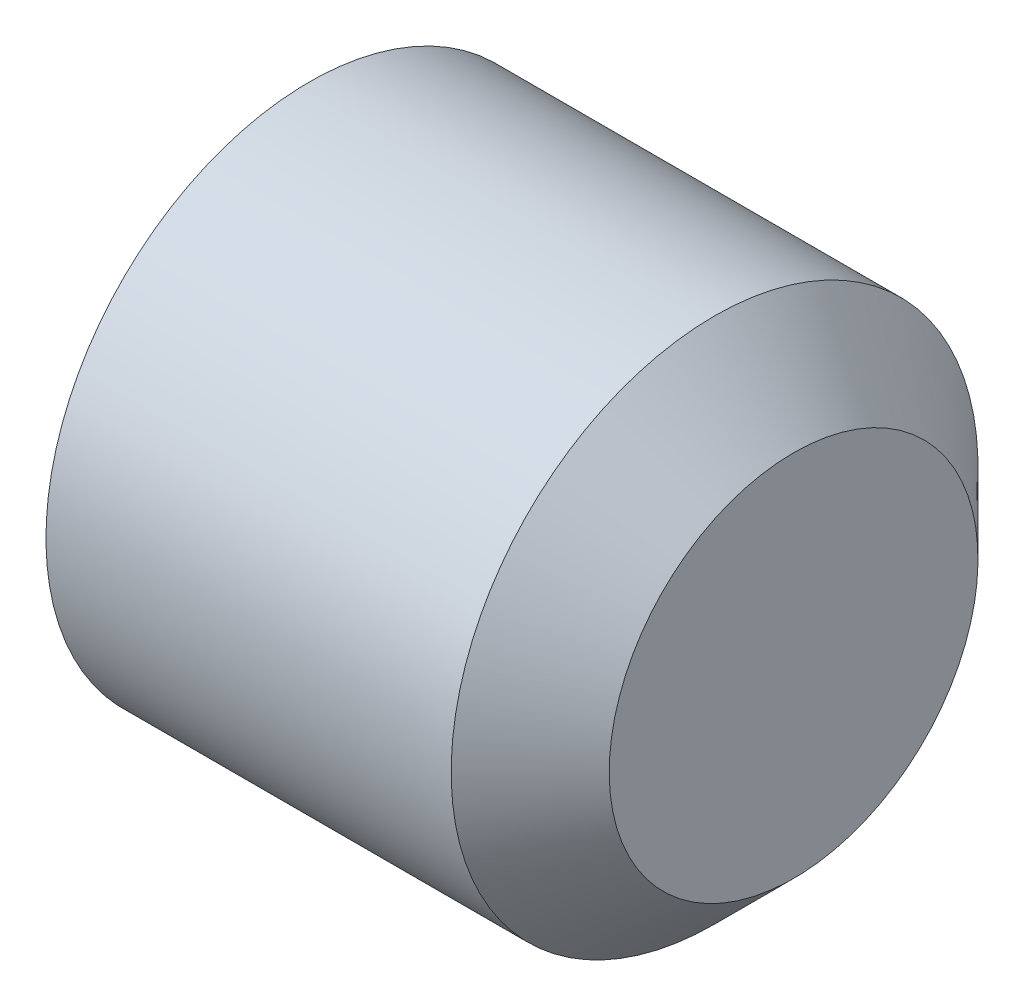
ISO-10303-21;
HEADER;
FILE_DESCRIPTION(('STEP AP214'),'2;1');
FILE_NAME('part.step','',(''),(''),'','','');
FILE_SCHEMA(('AUTOMOTIVE_DESIGN { 1 0 10303 214 1 1 1 1 }'));
ENDSEC;
DATA;
#1=APPLICATION_CONTEXT('core data for automotive mechanical design processes');
#2=APPLICATION_PROTOCOL_DEFINITION('international standard','automotive_design',2000,#1);
#3=PRODUCT_CONTEXT('',#1,'mechanical');
#4=PRODUCT('Part','Part','',(#3));
#5=PRODUCT_RELATED_PRODUCT_CATEGORY('part','',(#4));
#6=PRODUCT_DEFINITION_FORMATION('','',#4);
#7=PRODUCT_DEFINITION_CONTEXT('part definition',#1,'design');
#8=PRODUCT_DEFINITION('design','',#6,#7);
#9=PRODUCT_DEFINITION_SHAPE('','',#8);
#10=(LENGTH_UNIT() NAMED_UNIT(*) SI_UNIT(.MILLI.,.METRE.));
#11=(NAMED_UNIT(*) PLANE_ANGLE_UNIT() SI_UNIT($,.RADIAN.));
#12=(NAMED_UNIT(*) SI_UNIT($,.STERADIAN.) SOLID_ANGLE_UNIT());
#13=UNCERTAINTY_MEASURE_WITH_UNIT(LENGTH_MEASURE(1.E-05),#10,'distance_accuracy_value','');
#14=(GEOMETRIC_REPRESENTATION_CONTEXT(3) GLOBAL_UNCERTAINTY_ASSIGNED_CONTEXT((#13)) GLOBAL_UNIT_ASSIGNED_CONTEXT((#10,
#11,#12)) REPRESENTATION_CONTEXT('',''));
#15=CARTESIAN_POINT('',(0.,0.,0.));
#16=DIRECTION('',(0.,0.,1.));
#17=DIRECTION('',(1.,0.,0.));
#18=AXIS2_PLACEMENT_3D('',#15,#16,#17);
#19=CARTESIAN_POINT('',(5.,0.,0.));
#20=DIRECTION('',(-1.,0.,0.));
#21=DIRECTION('',(0.,-1.,0.));
#22=AXIS2_PLACEMENT_3D('',#19,#20,#21);
#23=CYLINDRICAL_SURFACE('',#22,2.5);
#24=CARTESIAN_POINT('',(0.404145188406358,0.,0.));
#25=DIRECTION('',(-1.,0.,0.));
#26=DIRECTION('',(0.,-1.,0.));
#27=AXIS2_PLACEMENT_3D('',#24,#25,#26);
#28=CIRCLE('',#27,2.5);
#29=CARTESIAN_POINT('',(0.404145188406358,-2.5,0.));
#30=VERTEX_POINT('',#29);
#31=EDGE_CURVE('E146',#30,#30,#28,.F.);
#32=ORIENTED_EDGE('',*,*,#31,.T.);
#33=EDGE_LOOP('',(#32));
#34=FACE_BOUND('',#33,.T.);
#35=CARTESIAN_POINT('',(4.25000000007162,0.,0.));
#36=DIRECTION('',(1.,0.,0.));
#37=DIRECTION('',(0.,1.,0.));
#38=AXIS2_PLACEMENT_3D('',#35,#36,#37);
#39=CIRCLE('',#38,2.5);
#40=CARTESIAN_POINT('',(4.25000000007162,2.5,0.));
#41=VERTEX_POINT('',#40);
#42=EDGE_CURVE('E256',#41,#41,#39,.F.);
#43=ORIENTED_EDGE('',*,*,#42,.T.);
#44=EDGE_LOOP('',(#43));
#45=FACE_BOUND('',#44,.T.);
#46=ADVANCED_FACE('F35',(#34,#45),#23,.T.);
#47=CARTESIAN_POINT('',(5.,2.5,0.));
#48=DIRECTION('',(1.,0.,0.));
#49=DIRECTION('',(0.,1.,0.));
#50=AXIS2_PLACEMENT_3D('',#47,#48,#49);
#51=PLANE('',#50);
#52=CARTESIAN_POINT('',(5.,0.,0.));
#53=DIRECTION('',(1.,0.,0.));
#54=DIRECTION('',(0.,1.,0.));
#55=AXIS2_PLACEMENT_3D('',#52,#53,#54);
#56=CIRCLE('',#55,1.75000000001478);
#57=CARTESIAN_POINT('',(5.,1.75000000001478,0.));
#58=VERTEX_POINT('',#57);
#59=EDGE_CURVE('E259',#58,#58,#56,.T.);
#60=ORIENTED_EDGE('',*,*,#59,.T.);
#61=EDGE_LOOP('',(#60));
#62=FACE_BOUND('',#61,.T.);
#63=ADVANCED_FACE('F312',(#62),#51,.T.);
#64=CARTESIAN_POINT('',(0.,0.,0.));
#65=DIRECTION('',(-1.,0.,0.));
#66=DIRECTION('',(0.,-1.,0.));
#67=AXIS2_PLACEMENT_3D('',#64,#65,#66);
#68=PLANE('',#67);
#69=DIRECTION('',(0.,0.866025403784439,-0.5));
#70=VECTOR('',#69,1.);
#71=CARTESIAN_POINT('',(0.,0.0500000000000003,1.52997821335251));
#72=LINE('',#71,#70);
#73=CARTESIAN_POINT('',(0.,1.35,0.779422863405994));
#74=VERTEX_POINT('',#73);
#75=CARTESIAN_POINT('',(0.,0.,1.55884572681199));
#76=VERTEX_POINT('',#75);
#77=EDGE_CURVE('E52',#74,#76,#72,.F.);
#78=ORIENTED_EDGE('',*,*,#77,.T.);
#79=DIRECTION('',(0.,0.866025403784439,0.5));
#80=VECTOR('',#79,1.);
#81=CARTESIAN_POINT('',(0.,-1.3,0.808290376865476));
#82=LINE('',#81,#80);
#83=CARTESIAN_POINT('',(0.,-1.35,0.779422863405995));
#84=VERTEX_POINT('',#83);
#85=EDGE_CURVE('E44',#76,#84,#82,.F.);
#86=ORIENTED_EDGE('',*,*,#85,.T.);
#87=DIRECTION('',(0.,0.,1.));
#88=VECTOR('',#87,1.);
#89=CARTESIAN_POINT('',(0.,-1.35,-0.721687836487032));
#90=LINE('',#89,#88);
#91=CARTESIAN_POINT('',(0.,-1.35,-0.779422863405994));
#92=VERTEX_POINT('',#91);
#93=EDGE_CURVE('E184',#84,#92,#90,.F.);
#94=ORIENTED_EDGE('',*,*,#93,.T.);
#95=DIRECTION('',(0.,-0.866025403784439,0.5));
#96=VECTOR('',#95,1.);
#97=CARTESIAN_POINT('',(0.,-0.0499999999999996,-1.52997821335251));
#98=LINE('',#97,#96);
#99=CARTESIAN_POINT('',(0.,0.,-1.55884572681199));
#100=VERTEX_POINT('',#99);
#101=EDGE_CURVE('E186',#92,#100,#98,.F.);
#102=ORIENTED_EDGE('',*,*,#101,.T.);
#103=DIRECTION('',(0.,-0.866025403784439,-0.5));
#104=VECTOR('',#103,1.);
#105=CARTESIAN_POINT('',(0.,1.3,-0.808290376865476));
#106=LINE('',#105,#104);
#107=CARTESIAN_POINT('',(0.,1.35,-0.779422863405995));
#108=VERTEX_POINT('',#107);
#109=EDGE_CURVE('E188',#100,#108,#106,.F.);
#110=ORIENTED_EDGE('',*,*,#109,.T.);
#111=DIRECTION('',(0.,0.,-1.));
#112=VECTOR('',#111,1.);
#113=CARTESIAN_POINT('',(0.,1.35,0.721687836487032));
#114=LINE('',#113,#112);
#115=EDGE_CURVE('E57',#108,#74,#114,.F.);
#116=ORIENTED_EDGE('',*,*,#115,.T.);
#117=EDGE_LOOP('',(#78,#86,#94,#102,#110,#116));
#118=FACE_BOUND('',#117,.T.);
#119=CARTESIAN_POINT('',(0.,0.,0.));
#120=DIRECTION('',(-1.,0.,0.));
#121=DIRECTION('',(0.,-1.,0.));
#122=AXIS2_PLACEMENT_3D('',#119,#120,#121);
#123=CIRCLE('',#122,1.7732050807584);
#124=CARTESIAN_POINT('',(0.,-1.7732050807584,0.));
#125=VERTEX_POINT('',#124);
#126=EDGE_CURVE('E181',#125,#125,#123,.T.);
#127=ORIENTED_EDGE('',*,*,#126,.T.);
#128=EDGE_LOOP('',(#127));
#129=FACE_BOUND('',#128,.T.);
#130=ADVANCED_FACE('F230',(#118,#129),#68,.T.);
#131=CARTESIAN_POINT('',(1.5,-1.25,-0.721687836487032));
#132=DIRECTION('',(0.,-1.,0.));
#133=DIRECTION('',(0.,0.,-1.));
#134=AXIS2_PLACEMENT_3D('',#131,#132,#133);
#135=PLANE('',#134);
#136=DIRECTION('',(-1.,0.,0.));
#137=VECTOR('',#136,1.);
#138=CARTESIAN_POINT('',(1.5,-1.25,0.721687836487032));
#139=LINE('',#138,#137);
#140=CARTESIAN_POINT('',(1.4,-1.25,0.721687836487032));
#141=VERTEX_POINT('',#140);
#142=CARTESIAN_POINT('',(0.1,-1.25,0.721687836487032));
#143=VERTEX_POINT('',#142);
#144=EDGE_CURVE('E204',#141,#143,#139,.T.);
#145=ORIENTED_EDGE('',*,*,#144,.F.);
#146=DIRECTION('',(0.,0.,1.));
#147=VECTOR('',#146,1.);
#148=CARTESIAN_POINT('',(1.4,-1.25,-0.721687836487032));
#149=LINE('',#148,#147);
#150=CARTESIAN_POINT('',(1.4,-1.25,-0.721687836487032));
#151=VERTEX_POINT('',#150);
#152=EDGE_CURVE('E179',#141,#151,#149,.F.);
#153=ORIENTED_EDGE('',*,*,#152,.T.);
#154=DIRECTION('',(-1.,0.,0.));
#155=VECTOR('',#154,1.);
#156=CARTESIAN_POINT('',(1.5,-1.25,-0.721687836487032));
#157=LINE('',#156,#155);
#158=CARTESIAN_POINT('',(0.1,-1.25,-0.721687836487032));
#159=VERTEX_POINT('',#158);
#160=EDGE_CURVE('E244',#151,#159,#157,.T.);
#161=ORIENTED_EDGE('',*,*,#160,.T.);
#162=DIRECTION('',(0.,0.,1.));
#163=VECTOR('',#162,1.);
#164=CARTESIAN_POINT('',(0.1,-1.25,0.721687836487032));
#165=LINE('',#164,#163);
#166=EDGE_CURVE('E177',#159,#143,#165,.T.);
#167=ORIENTED_EDGE('',*,*,#166,.T.);
#168=EDGE_LOOP('',(#145,#153,#161,#167));
#169=FACE_BOUND('',#168,.T.);
#170=ADVANCED_FACE('F242',(#169),#135,.F.);
#171=CARTESIAN_POINT('',(1.5,0.,-1.44337567297406));
#172=DIRECTION('',(0.,-0.5,-0.866025403784439));
#173=DIRECTION('',(0.,0.866025403784439,-0.5));
#174=AXIS2_PLACEMENT_3D('',#171,#172,#173);
#175=PLANE('',#174);
#176=ORIENTED_EDGE('',*,*,#160,.F.);
#177=DIRECTION('',(0.,-0.866025403784439,0.5));
#178=VECTOR('',#177,1.);
#179=CARTESIAN_POINT('',(1.4,0.,-1.44337567297406));
#180=LINE('',#179,#178);
#181=CARTESIAN_POINT('',(1.4,0.,-1.44337567297406));
#182=VERTEX_POINT('',#181);
#183=EDGE_CURVE('E133',#151,#182,#180,.F.);
#184=ORIENTED_EDGE('',*,*,#183,.T.);
#185=DIRECTION('',(-1.,0.,0.));
#186=VECTOR('',#185,1.);
#187=CARTESIAN_POINT('',(1.5,0.,-1.44337567297406));
#188=LINE('',#187,#186);
#189=CARTESIAN_POINT('',(0.1,0.,-1.44337567297406));
#190=VERTEX_POINT('',#189);
#191=EDGE_CURVE('E283',#182,#190,#188,.T.);
#192=ORIENTED_EDGE('',*,*,#191,.T.);
#193=DIRECTION('',(0.,-0.866025403784439,0.5));
#194=VECTOR('',#193,1.);
#195=CARTESIAN_POINT('',(0.1,-1.25,-0.721687836487032));
#196=LINE('',#195,#194);
#197=EDGE_CURVE('E152',#190,#159,#196,.T.);
#198=ORIENTED_EDGE('',*,*,#197,.T.);
#199=EDGE_LOOP('',(#176,#184,#192,#198));
#200=FACE_BOUND('',#199,.T.);
#201=ADVANCED_FACE('F282',(#200),#175,.F.);
#202=CARTESIAN_POINT('',(1.5,1.25,-0.721687836487032));
#203=DIRECTION('',(0.,0.5,-0.866025403784439));
#204=DIRECTION('',(0.,0.866025403784439,0.5));
#205=AXIS2_PLACEMENT_3D('',#202,#203,#204);
#206=PLANE('',#205);
#207=ORIENTED_EDGE('',*,*,#191,.F.);
#208=DIRECTION('',(0.,-0.866025403784439,-0.5));
#209=VECTOR('',#208,1.);
#210=CARTESIAN_POINT('',(1.4,1.25,-0.721687836487032));
#211=LINE('',#210,#209);
#212=CARTESIAN_POINT('',(1.4,1.25,-0.721687836487032));
#213=VERTEX_POINT('',#212);
#214=EDGE_CURVE('E162',#182,#213,#211,.F.);
#215=ORIENTED_EDGE('',*,*,#214,.T.);
#216=DIRECTION('',(-1.,0.,0.));
#217=VECTOR('',#216,1.);
#218=CARTESIAN_POINT('',(1.5,1.25,-0.721687836487032));
#219=LINE('',#218,#217);
#220=CARTESIAN_POINT('',(0.1,1.25,-0.721687836487032));
#221=VERTEX_POINT('',#220);
#222=EDGE_CURVE('E285',#213,#221,#219,.T.);
#223=ORIENTED_EDGE('',*,*,#222,.T.);
#224=DIRECTION('',(0.,-0.866025403784439,-0.5));
#225=VECTOR('',#224,1.);
#226=CARTESIAN_POINT('',(0.1,0.,-1.44337567297406));
#227=LINE('',#226,#225);
#228=EDGE_CURVE('E160',#221,#190,#227,.T.);
#229=ORIENTED_EDGE('',*,*,#228,.T.);
#230=EDGE_LOOP('',(#207,#215,#223,#229));
#231=FACE_BOUND('',#230,.T.);
#232=ADVANCED_FACE('F284',(#231),#206,.F.);
#233=CARTESIAN_POINT('',(1.5,1.25,0.721687836487032));
#234=DIRECTION('',(0.,1.,0.));
#235=DIRECTION('',(0.,0.,1.));
#236=AXIS2_PLACEMENT_3D('',#233,#234,#235);
#237=PLANE('',#236);
#238=ORIENTED_EDGE('',*,*,#222,.F.);
#239=DIRECTION('',(0.,0.,-1.));
#240=VECTOR('',#239,1.);
#241=CARTESIAN_POINT('',(1.4,1.25,0.721687836487032));
#242=LINE('',#241,#240);
#243=CARTESIAN_POINT('',(1.4,1.25,0.721687836487032));
#244=VERTEX_POINT('',#243);
#245=EDGE_CURVE('E166',#213,#244,#242,.F.);
#246=ORIENTED_EDGE('',*,*,#245,.T.);
#247=DIRECTION('',(-1.,0.,0.));
#248=VECTOR('',#247,1.);
#249=CARTESIAN_POINT('',(1.5,1.25,0.721687836487032));
#250=LINE('',#249,#248);
#251=CARTESIAN_POINT('',(0.1,1.25,0.721687836487032));
#252=VERTEX_POINT('',#251);
#253=EDGE_CURVE('E252',#244,#252,#250,.T.);
#254=ORIENTED_EDGE('',*,*,#253,.T.);
#255=DIRECTION('',(0.,0.,-1.));
#256=VECTOR('',#255,1.);
#257=CARTESIAN_POINT('',(0.1,1.25,-0.721687836487032));
#258=LINE('',#257,#256);
#259=EDGE_CURVE('E164',#252,#221,#258,.T.);
#260=ORIENTED_EDGE('',*,*,#259,.T.);
#261=EDGE_LOOP('',(#238,#246,#254,#260));
#262=FACE_BOUND('',#261,.T.);
#263=ADVANCED_FACE('F292',(#262),#237,.F.);
#264=CARTESIAN_POINT('',(1.5,0.,1.44337567297406));
#265=DIRECTION('',(0.,0.5,0.866025403784438));
#266=DIRECTION('',(0.,-0.866025403784439,0.5));
#267=AXIS2_PLACEMENT_3D('',#264,#265,#266);
#268=PLANE('',#267);
#269=ORIENTED_EDGE('',*,*,#253,.F.);
#270=DIRECTION('',(0.,0.866025403784439,-0.5));
#271=VECTOR('',#270,1.);
#272=CARTESIAN_POINT('',(1.4,0.,1.44337567297406));
#273=LINE('',#272,#271);
#274=CARTESIAN_POINT('',(1.4,0.,1.44337567297406));
#275=VERTEX_POINT('',#274);
#276=EDGE_CURVE('E170',#244,#275,#273,.F.);
#277=ORIENTED_EDGE('',*,*,#276,.T.);
#278=DIRECTION('',(-1.,0.,0.));
#279=VECTOR('',#278,1.);
#280=CARTESIAN_POINT('',(1.5,0.,1.44337567297406));
#281=LINE('',#280,#279);
#282=CARTESIAN_POINT('',(0.1,0.,1.44337567297406));
#283=VERTEX_POINT('',#282);
#284=EDGE_CURVE('E250',#275,#283,#281,.T.);
#285=ORIENTED_EDGE('',*,*,#284,.T.);
#286=DIRECTION('',(0.,0.866025403784439,-0.5));
#287=VECTOR('',#286,1.);
#288=CARTESIAN_POINT('',(0.1,1.25,0.721687836487031));
#289=LINE('',#288,#287);
#290=EDGE_CURVE('E168',#283,#252,#289,.T.);
#291=ORIENTED_EDGE('',*,*,#290,.T.);
#292=EDGE_LOOP('',(#269,#277,#285,#291));
#293=FACE_BOUND('',#292,.T.);
#294=ADVANCED_FACE('F348',(#293),#268,.F.);
#295=CARTESIAN_POINT('',(1.5,-1.25,0.721687836487032));
#296=DIRECTION('',(0.,-0.5,0.866025403784439));
#297=DIRECTION('',(0.,-0.866025403784439,-0.5));
#298=AXIS2_PLACEMENT_3D('',#295,#296,#297);
#299=PLANE('',#298);
#300=ORIENTED_EDGE('',*,*,#284,.F.);
#301=DIRECTION('',(0.,0.866025403784439,0.5));
#302=VECTOR('',#301,1.);
#303=CARTESIAN_POINT('',(1.4,-1.25,0.721687836487032));
#304=LINE('',#303,#302);
#305=EDGE_CURVE('E175',#275,#141,#304,.F.);
#306=ORIENTED_EDGE('',*,*,#305,.T.);
#307=ORIENTED_EDGE('',*,*,#144,.T.);
#308=DIRECTION('',(0.,0.866025403784439,0.5));
#309=VECTOR('',#308,1.);
#310=CARTESIAN_POINT('',(0.1,0.,1.44337567297406));
#311=LINE('',#310,#309);
#312=EDGE_CURVE('E172',#143,#283,#311,.T.);
#313=ORIENTED_EDGE('',*,*,#312,.T.);
#314=EDGE_LOOP('',(#300,#306,#307,#313));
#315=FACE_BOUND('',#314,.T.);
#316=ADVANCED_FACE('F247',(#315),#299,.F.);
#317=CARTESIAN_POINT('',(1.5,0.,0.));
#318=DIRECTION('',(-1.,0.,0.));
#319=DIRECTION('',(0.,0.,1.));
#320=AXIS2_PLACEMENT_3D('',#317,#318,#319);
#321=PLANE('',#320);
#322=DIRECTION('',(0.,-0.866025403784439,-0.5));
#323=VECTOR('',#322,1.);
#324=CARTESIAN_POINT('',(1.5,0.575,-0.995929214352104));
#325=LINE('',#324,#323);
#326=CARTESIAN_POINT('',(1.5,1.15,-0.66395280956807));
#327=VERTEX_POINT('',#326);
#328=CARTESIAN_POINT('',(1.5,0.,-1.32790561913614));
#329=VERTEX_POINT('',#328);
#330=EDGE_CURVE('E150',#327,#329,#325,.T.);
#331=ORIENTED_EDGE('',*,*,#330,.T.);
#332=DIRECTION('',(0.,-0.866025403784439,0.5));
#333=VECTOR('',#332,1.);
#334=CARTESIAN_POINT('',(1.5,-0.575,-0.995929214352104));
#335=LINE('',#334,#333);
#336=CARTESIAN_POINT('',(1.5,-1.15,-0.663952809568069));
#337=VERTEX_POINT('',#336);
#338=EDGE_CURVE('E131',#329,#337,#335,.T.);
#339=ORIENTED_EDGE('',*,*,#338,.T.);
#340=DIRECTION('',(0.,0.,1.));
#341=VECTOR('',#340,1.);
#342=CARTESIAN_POINT('',(1.5,-1.15,0.));
#343=LINE('',#342,#341);
#344=CARTESIAN_POINT('',(1.5,-1.15,0.663952809568069));
#345=VERTEX_POINT('',#344);
#346=EDGE_CURVE('E139',#337,#345,#343,.T.);
#347=ORIENTED_EDGE('',*,*,#346,.T.);
#348=DIRECTION('',(0.,0.866025403784439,0.5));
#349=VECTOR('',#348,1.);
#350=CARTESIAN_POINT('',(1.5,-0.575,0.995929214352104));
#351=LINE('',#350,#349);
#352=CARTESIAN_POINT('',(1.5,0.,1.32790561913614));
#353=VERTEX_POINT('',#352);
#354=EDGE_CURVE('E145',#345,#353,#351,.T.);
#355=ORIENTED_EDGE('',*,*,#354,.T.);
#356=DIRECTION('',(0.,0.866025403784439,-0.5));
#357=VECTOR('',#356,1.);
#358=CARTESIAN_POINT('',(1.5,0.575,0.995929214352104));
#359=LINE('',#358,#357);
#360=CARTESIAN_POINT('',(1.5,1.15,0.663952809568069));
#361=VERTEX_POINT('',#360);
#362=EDGE_CURVE('E265',#353,#361,#359,.T.);
#363=ORIENTED_EDGE('',*,*,#362,.T.);
#364=DIRECTION('',(0.,0.,-1.));
#365=VECTOR('',#364,1.);
#366=CARTESIAN_POINT('',(1.5,1.15,0.));
#367=LINE('',#366,#365);
#368=EDGE_CURVE('E155',#361,#327,#367,.T.);
#369=ORIENTED_EDGE('',*,*,#368,.T.);
#370=EDGE_LOOP('',(#331,#339,#347,#355,#363,#369));
#371=FACE_BOUND('',#370,.T.);
#372=ADVANCED_FACE('F148',(#371),#321,.T.);
#373=CARTESIAN_POINT('',(4.25000000007162,0.,0.));
#374=DIRECTION('',(-1.,0.,0.));
#375=DIRECTION('',(0.,-1.,0.));
#376=AXIS2_PLACEMENT_3D('',#373,#374,#375);
#377=CONICAL_SURFACE('',#376,2.5,0.785398163435348);
#378=ORIENTED_EDGE('',*,*,#59,.F.);
#379=EDGE_LOOP('',(#378));
#380=FACE_BOUND('',#379,.T.);
#381=ORIENTED_EDGE('',*,*,#42,.F.);
#382=EDGE_LOOP('',(#381));
#383=FACE_BOUND('',#382,.T.);
#384=ADVANCED_FACE('F323',(#380,#383),#377,.T.);
#385=CARTESIAN_POINT('',(0.,0.,0.));
#386=DIRECTION('',(1.,0.,0.));
#387=DIRECTION('',(0.,1.,0.));
#388=AXIS2_PLACEMENT_3D('',#385,#386,#387);
#389=CONICAL_SURFACE('',#388,1.8,1.04719755122486);
#390=CARTESIAN_POINT('',(0.013397459620143,0.,0.));
#391=DIRECTION('',(-1.,0.,0.));
#392=DIRECTION('',(0.,-1.,0.));
#393=AXIS2_PLACEMENT_3D('',#390,#391,#392);
#394=CIRCLE('',#393,1.82320508075595);
#395=CARTESIAN_POINT('',(0.013397459620143,-1.82320508075595,0.));
#396=VERTEX_POINT('',#395);
#397=EDGE_CURVE('E11',#396,#396,#394,.F.);
#398=ORIENTED_EDGE('',*,*,#397,.T.);
#399=EDGE_LOOP('',(#398));
#400=FACE_BOUND('',#399,.T.);
#401=ORIENTED_EDGE('',*,*,#31,.F.);
#402=EDGE_LOOP('',(#401));
#403=FACE_BOUND('',#402,.T.);
#404=ADVANCED_FACE('F326',(#400,#403),#389,.T.);
#405=CARTESIAN_POINT('',(1.4,0.575,0.995929214352104));
#406=DIRECTION('',(0.,0.866025403784439,-0.5));
#407=DIRECTION('',(0.,0.5,0.866025403784438));
#408=AXIS2_PLACEMENT_3D('',#405,#406,#407);
#409=CYLINDRICAL_SURFACE('',#408,0.1);
#410=CARTESIAN_POINT('',(1.4,0.,1.32790561913614));
#411=DIRECTION('',(0.,1.,0.));
#412=DIRECTION('',(0.,0.,-1.));
#413=AXIS2_PLACEMENT_3D('',#410,#411,#412);
#414=ELLIPSE('',#413,0.115470053837925,0.1);
#415=EDGE_CURVE('E198',#275,#353,#414,.T.);
#416=ORIENTED_EDGE('',*,*,#415,.F.);
#417=ORIENTED_EDGE('',*,*,#276,.F.);
#418=CARTESIAN_POINT('',(1.4,1.15,0.663952809568069));
#419=DIRECTION('',(0.,0.5,-0.866025403784439));
#420=DIRECTION('',(0.,-0.866025403784439,-0.5));
#421=AXIS2_PLACEMENT_3D('',#418,#419,#420);
#422=ELLIPSE('',#421,0.115470053837925,0.1);
#423=EDGE_CURVE('E201',#361,#244,#422,.F.);
#424=ORIENTED_EDGE('',*,*,#423,.F.);
#425=ORIENTED_EDGE('',*,*,#362,.F.);
#426=EDGE_LOOP('',(#416,#417,#424,#425));
#427=FACE_BOUND('',#426,.T.);
#428=ADVANCED_FACE('F330',(#427),#409,.F.);
#429=CARTESIAN_POINT('',(1.4,1.15,0.));
#430=DIRECTION('',(0.,0.,-1.));
#431=DIRECTION('',(0.,1.,0.));
#432=AXIS2_PLACEMENT_3D('',#429,#430,#431);
#433=CYLINDRICAL_SURFACE('',#432,0.1);
#434=ORIENTED_EDGE('',*,*,#423,.T.);
#435=ORIENTED_EDGE('',*,*,#245,.F.);
#436=CARTESIAN_POINT('',(1.4,1.15,-0.66395280956807));
#437=DIRECTION('',(0.,-0.5,-0.866025403784439));
#438=DIRECTION('',(0.,-0.866025403784439,0.5));
#439=AXIS2_PLACEMENT_3D('',#436,#437,#438);
#440=ELLIPSE('',#439,0.115470053837925,0.1);
#441=EDGE_CURVE('E195',#327,#213,#440,.F.);
#442=ORIENTED_EDGE('',*,*,#441,.F.);
#443=ORIENTED_EDGE('',*,*,#368,.F.);
#444=EDGE_LOOP('',(#434,#435,#442,#443));
#445=FACE_BOUND('',#444,.T.);
#446=ADVANCED_FACE('F272',(#445),#433,.F.);
#447=CARTESIAN_POINT('',(1.4,-0.575,0.995929214352104));
#448=DIRECTION('',(0.,0.866025403784439,0.5));
#449=DIRECTION('',(0.,-0.5,0.866025403784439));
#450=AXIS2_PLACEMENT_3D('',#447,#448,#449);
#451=CYLINDRICAL_SURFACE('',#450,0.1);
#452=ORIENTED_EDGE('',*,*,#415,.T.);
#453=ORIENTED_EDGE('',*,*,#354,.F.);
#454=CARTESIAN_POINT('',(1.4,-1.15,0.663952809568069));
#455=DIRECTION('',(0.,0.5,0.866025403784439));
#456=DIRECTION('',(0.,0.866025403784439,-0.5));
#457=AXIS2_PLACEMENT_3D('',#454,#455,#456);
#458=ELLIPSE('',#457,0.115470053837925,0.1);
#459=EDGE_CURVE('E142',#141,#345,#458,.T.);
#460=ORIENTED_EDGE('',*,*,#459,.F.);
#461=ORIENTED_EDGE('',*,*,#305,.F.);
#462=EDGE_LOOP('',(#452,#453,#460,#461));
#463=FACE_BOUND('',#462,.T.);
#464=ADVANCED_FACE('F338',(#463),#451,.F.);
#465=CARTESIAN_POINT('',(1.4,0.575,-0.995929214352104));
#466=DIRECTION('',(0.,-0.866025403784439,-0.5));
#467=DIRECTION('',(0.,0.5,-0.866025403784439));
#468=AXIS2_PLACEMENT_3D('',#465,#466,#467);
#469=CYLINDRICAL_SURFACE('',#468,0.1);
#470=ORIENTED_EDGE('',*,*,#441,.T.);
#471=ORIENTED_EDGE('',*,*,#214,.F.);
#472=CARTESIAN_POINT('',(1.4,0.,-1.32790561913614));
#473=DIRECTION('',(0.,-1.,0.));
#474=DIRECTION('',(0.,0.,1.));
#475=AXIS2_PLACEMENT_3D('',#472,#473,#474);
#476=ELLIPSE('',#475,0.115470053837925,0.1);
#477=EDGE_CURVE('E136',#329,#182,#476,.F.);
#478=ORIENTED_EDGE('',*,*,#477,.F.);
#479=ORIENTED_EDGE('',*,*,#330,.F.);
#480=EDGE_LOOP('',(#470,#471,#478,#479));
#481=FACE_BOUND('',#480,.T.);
#482=ADVANCED_FACE('F275',(#481),#469,.F.);
#483=CARTESIAN_POINT('',(1.4,-1.15,0.));
#484=DIRECTION('',(0.,0.,1.));
#485=DIRECTION('',(1.,0.,0.));
#486=AXIS2_PLACEMENT_3D('',#483,#484,#485);
#487=CYLINDRICAL_SURFACE('',#486,0.1);
#488=ORIENTED_EDGE('',*,*,#459,.T.);
#489=ORIENTED_EDGE('',*,*,#346,.F.);
#490=CARTESIAN_POINT('',(1.4,-1.15,-0.663952809568069));
#491=DIRECTION('',(0.,-0.5,0.866025403784439));
#492=DIRECTION('',(0.,-0.866025403784439,-0.5));
#493=AXIS2_PLACEMENT_3D('',#490,#491,#492);
#494=ELLIPSE('',#493,0.115470053837925,0.1);
#495=EDGE_CURVE('E127',#151,#337,#494,.T.);
#496=ORIENTED_EDGE('',*,*,#495,.F.);
#497=ORIENTED_EDGE('',*,*,#152,.F.);
#498=EDGE_LOOP('',(#488,#489,#496,#497));
#499=FACE_BOUND('',#498,.T.);
#500=ADVANCED_FACE('F140',(#499),#487,.F.);
#501=CARTESIAN_POINT('',(1.4,-0.575,-0.995929214352104));
#502=DIRECTION('',(0.,-0.866025403784439,0.5));
#503=DIRECTION('',(0.,-0.5,-0.866025403784439));
#504=AXIS2_PLACEMENT_3D('',#501,#502,#503);
#505=CYLINDRICAL_SURFACE('',#504,0.1);
#506=ORIENTED_EDGE('',*,*,#477,.T.);
#507=ORIENTED_EDGE('',*,*,#183,.F.);
#508=ORIENTED_EDGE('',*,*,#495,.T.);
#509=ORIENTED_EDGE('',*,*,#338,.F.);
#510=EDGE_LOOP('',(#506,#507,#508,#509));
#511=FACE_BOUND('',#510,.T.);
#512=ADVANCED_FACE('F129',(#511),#505,.F.);
#513=CARTESIAN_POINT('',(0.1,1.3,-0.808290376865476));
#514=DIRECTION('',(0.,0.866025403784439,0.5));
#515=DIRECTION('',(0.,-0.5,0.866025403784439));
#516=AXIS2_PLACEMENT_3D('',#513,#514,#515);
#517=CYLINDRICAL_SURFACE('',#516,0.1);
#518=CARTESIAN_POINT('',(0.1,1.35,-0.779422863405995));
#519=DIRECTION('',(0.,0.5,0.866025403784439));
#520=DIRECTION('',(0.,-0.866025403784439,0.5));
#521=AXIS2_PLACEMENT_3D('',#518,#519,#520);
#522=ELLIPSE('',#521,0.115470053837925,0.1);
#523=EDGE_CURVE('E214',#108,#221,#522,.T.);
#524=ORIENTED_EDGE('',*,*,#523,.F.);
#525=ORIENTED_EDGE('',*,*,#109,.F.);
#526=CARTESIAN_POINT('',(0.1,0.,-1.55884572681199));
#527=DIRECTION('',(0.,1.,0.));
#528=DIRECTION('',(0.,0.,1.));
#529=AXIS2_PLACEMENT_3D('',#526,#527,#528);
#530=ELLIPSE('',#529,0.115470053837925,0.1);
#531=EDGE_CURVE('E39',#190,#100,#530,.F.);
#532=ORIENTED_EDGE('',*,*,#531,.F.);
#533=ORIENTED_EDGE('',*,*,#228,.F.);
#534=EDGE_LOOP('',(#524,#525,#532,#533));
#535=FACE_BOUND('',#534,.T.);
#536=ADVANCED_FACE('F229',(#535),#517,.T.);
#537=CARTESIAN_POINT('',(0.1,-0.0499999999999996,-1.52997821335251));
#538=DIRECTION('',(0.,0.866025403784439,-0.5));
#539=DIRECTION('',(0.,0.5,0.866025403784439));
#540=AXIS2_PLACEMENT_3D('',#537,#538,#539);
#541=CYLINDRICAL_SURFACE('',#540,0.1);
#542=ORIENTED_EDGE('',*,*,#531,.T.);
#543=ORIENTED_EDGE('',*,*,#101,.F.);
#544=CARTESIAN_POINT('',(0.1,-1.35,-0.779422863405994));
#545=DIRECTION('',(0.,0.5,-0.866025403784439));
#546=DIRECTION('',(0.,0.866025403784439,0.5));
#547=AXIS2_PLACEMENT_3D('',#544,#545,#546);
#548=ELLIPSE('',#547,0.115470053837925,0.1);
#549=EDGE_CURVE('E212',#159,#92,#548,.F.);
#550=ORIENTED_EDGE('',*,*,#549,.F.);
#551=ORIENTED_EDGE('',*,*,#197,.F.);
#552=EDGE_LOOP('',(#542,#543,#550,#551));
#553=FACE_BOUND('',#552,.T.);
#554=ADVANCED_FACE('F224',(#553),#541,.T.);
#555=CARTESIAN_POINT('',(0.1,1.35,0.721687836487032));
#556=DIRECTION('',(0.,0.,1.));
#557=DIRECTION('',(0.,-1.,0.));
#558=AXIS2_PLACEMENT_3D('',#555,#556,#557);
#559=CYLINDRICAL_SURFACE('',#558,0.1);
#560=ORIENTED_EDGE('',*,*,#523,.T.);
#561=ORIENTED_EDGE('',*,*,#259,.F.);
#562=CARTESIAN_POINT('',(0.1,1.35,0.779422863405994));
#563=DIRECTION('',(0.,-0.5,0.866025403784439));
#564=DIRECTION('',(0.,-0.866025403784439,-0.5));
#565=AXIS2_PLACEMENT_3D('',#562,#563,#564);
#566=ELLIPSE('',#565,0.115470053837925,0.1);
#567=EDGE_CURVE('E209',#74,#252,#566,.T.);
#568=ORIENTED_EDGE('',*,*,#567,.F.);
#569=ORIENTED_EDGE('',*,*,#115,.F.);
#570=EDGE_LOOP('',(#560,#561,#568,#569));
#571=FACE_BOUND('',#570,.T.);
#572=ADVANCED_FACE('F295',(#571),#559,.T.);
#573=CARTESIAN_POINT('',(0.1,-1.35,-0.721687836487032));
#574=DIRECTION('',(0.,0.,-1.));
#575=DIRECTION('',(-1.,0.,0.));
#576=AXIS2_PLACEMENT_3D('',#573,#574,#575);
#577=CYLINDRICAL_SURFACE('',#576,0.1);
#578=ORIENTED_EDGE('',*,*,#549,.T.);
#579=ORIENTED_EDGE('',*,*,#93,.F.);
#580=CARTESIAN_POINT('',(0.1,-1.35,0.779422863405995));
#581=DIRECTION('',(0.,-0.5,-0.866025403784439));
#582=DIRECTION('',(0.,-0.866025403784439,0.5));
#583=AXIS2_PLACEMENT_3D('',#580,#581,#582);
#584=ELLIPSE('',#583,0.115470053837925,0.1);
#585=EDGE_CURVE('E207',#143,#84,#584,.F.);
#586=ORIENTED_EDGE('',*,*,#585,.F.);
#587=ORIENTED_EDGE('',*,*,#166,.F.);
#588=EDGE_LOOP('',(#578,#579,#586,#587));
#589=FACE_BOUND('',#588,.T.);
#590=ADVANCED_FACE('F235',(#589),#577,.T.);
#591=CARTESIAN_POINT('',(0.1,0.0500000000000002,1.52997821335251));
#592=DIRECTION('',(0.,-0.866025403784439,0.5));
#593=DIRECTION('',(0.,-0.5,-0.866025403784438));
#594=AXIS2_PLACEMENT_3D('',#591,#592,#593);
#595=CYLINDRICAL_SURFACE('',#594,0.1);
#596=ORIENTED_EDGE('',*,*,#567,.T.);
#597=ORIENTED_EDGE('',*,*,#290,.F.);
#598=CARTESIAN_POINT('',(0.1,0.,1.55884572681199));
#599=DIRECTION('',(0.,-1.,0.));
#600=DIRECTION('',(0.,0.,-1.));
#601=AXIS2_PLACEMENT_3D('',#598,#599,#600);
#602=ELLIPSE('',#601,0.115470053837925,0.1);
#603=EDGE_CURVE('E205',#76,#283,#602,.T.);
#604=ORIENTED_EDGE('',*,*,#603,.F.);
#605=ORIENTED_EDGE('',*,*,#77,.F.);
#606=EDGE_LOOP('',(#596,#597,#604,#605));
#607=FACE_BOUND('',#606,.T.);
#608=ADVANCED_FACE('F298',(#607),#595,.T.);
#609=CARTESIAN_POINT('',(0.1,-1.3,0.808290376865476));
#610=DIRECTION('',(0.,-0.866025403784439,-0.5));
#611=DIRECTION('',(0.,0.5,-0.866025403784439));
#612=AXIS2_PLACEMENT_3D('',#609,#610,#611);
#613=CYLINDRICAL_SURFACE('',#612,0.1);
#614=ORIENTED_EDGE('',*,*,#585,.T.);
#615=ORIENTED_EDGE('',*,*,#85,.F.);
#616=ORIENTED_EDGE('',*,*,#603,.T.);
#617=ORIENTED_EDGE('',*,*,#312,.F.);
#618=EDGE_LOOP('',(#614,#615,#616,#617));
#619=FACE_BOUND('',#618,.T.);
#620=ADVANCED_FACE('F301',(#619),#613,.T.);
#621=CARTESIAN_POINT('',(0.1,0.,0.));
#622=DIRECTION('',(-1.,0.,0.));
#623=DIRECTION('',(0.,-1.,0.));
#624=AXIS2_PLACEMENT_3D('',#621,#622,#623);
#625=TOROIDAL_SURFACE('',#624,1.7732050807584,0.1);
#626=ORIENTED_EDGE('',*,*,#397,.F.);
#627=EDGE_LOOP('',(#626));
#628=FACE_BOUND('',#627,.T.);
#629=ORIENTED_EDGE('',*,*,#126,.F.);
#630=EDGE_LOOP('',(#629));
#631=FACE_BOUND('',#630,.T.);
#632=ADVANCED_FACE('F37',(#628,#631),#625,.T.);
#633=CLOSED_SHELL('',(#46,#63,#130,#170,#201,#232,#263,#294,#316,#372,#384,#404,#428,#446,#464,
#482,#500,#512,#536,#554,#572,#590,#608,#620,#632));
#634=MANIFOLD_SOLID_BREP('B2',#633);
#635=ADVANCED_BREP_SHAPE_REPRESENTATION('',(#18,#634),#14);
#636=SHAPE_DEFINITION_REPRESENTATION(#9,#635);
ENDSEC;
END-ISO-10303-21;
